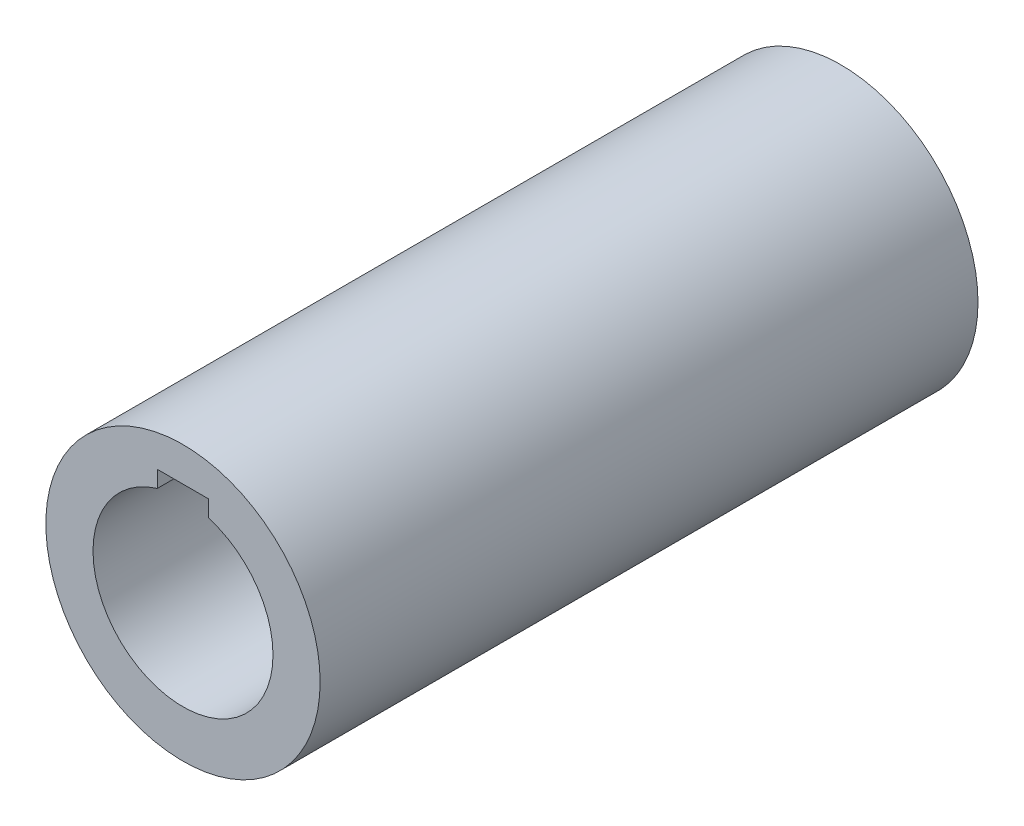
ISO-10303-21;
HEADER;
FILE_DESCRIPTION(('STEP AP214'),'2;1');
FILE_NAME('part.step','',(''),(''),'','','');
FILE_SCHEMA(('AUTOMOTIVE_DESIGN { 1 0 10303 214 1 1 1 1 }'));
ENDSEC;
DATA;
#1=APPLICATION_CONTEXT('core data for automotive mechanical design processes');
#2=APPLICATION_PROTOCOL_DEFINITION('international standard','automotive_design',2000,#1);
#3=PRODUCT_CONTEXT('',#1,'mechanical');
#4=PRODUCT('Part','Part','',(#3));
#5=PRODUCT_RELATED_PRODUCT_CATEGORY('part','',(#4));
#6=PRODUCT_DEFINITION_FORMATION('','',#4);
#7=PRODUCT_DEFINITION_CONTEXT('part definition',#1,'design');
#8=PRODUCT_DEFINITION('design','',#6,#7);
#9=PRODUCT_DEFINITION_SHAPE('','',#8);
#10=(LENGTH_UNIT() NAMED_UNIT(*) SI_UNIT(.MILLI.,.METRE.));
#11=(NAMED_UNIT(*) PLANE_ANGLE_UNIT() SI_UNIT($,.RADIAN.));
#12=(NAMED_UNIT(*) SI_UNIT($,.STERADIAN.) SOLID_ANGLE_UNIT());
#13=UNCERTAINTY_MEASURE_WITH_UNIT(LENGTH_MEASURE(1.E-05),#10,'distance_accuracy_value','');
#14=(GEOMETRIC_REPRESENTATION_CONTEXT(3) GLOBAL_UNCERTAINTY_ASSIGNED_CONTEXT((#13)) GLOBAL_UNIT_ASSIGNED_CONTEXT((#10,
#11,#12)) REPRESENTATION_CONTEXT('',''));
#15=CARTESIAN_POINT('',(0.,0.,0.));
#16=DIRECTION('',(0.,0.,1.));
#17=DIRECTION('',(1.,0.,0.));
#18=AXIS2_PLACEMENT_3D('',#15,#16,#17);
#19=CARTESIAN_POINT('',(0.,0.,153.5));
#20=DIRECTION('',(0.,0.,1.));
#21=DIRECTION('',(1.,0.,0.));
#22=AXIS2_PLACEMENT_3D('',#19,#20,#21);
#23=PLANE('',#22);
#24=DIRECTION('',(0.,-1.,0.));
#25=VECTOR('',#24,1.);
#26=CARTESIAN_POINT('',(-6.,24.,153.5));
#27=LINE('',#26,#25);
#28=CARTESIAN_POINT('',(-6.,24.,153.5));
#29=VERTEX_POINT('',#28);
#30=CARTESIAN_POINT('',(-6.,20.1246117974981,153.5));
#31=VERTEX_POINT('',#30);
#32=EDGE_CURVE('E81',#29,#31,#27,.T.);
#33=ORIENTED_EDGE('',*,*,#32,.F.);
#34=DIRECTION('',(-1.,0.,0.));
#35=VECTOR('',#34,1.);
#36=CARTESIAN_POINT('',(-6.,24.,153.5));
#37=LINE('',#36,#35);
#38=CARTESIAN_POINT('',(6.,24.,153.5));
#39=VERTEX_POINT('',#38);
#40=EDGE_CURVE('E93',#39,#29,#37,.T.);
#41=ORIENTED_EDGE('',*,*,#40,.F.);
#42=DIRECTION('',(0.,1.,0.));
#43=VECTOR('',#42,1.);
#44=CARTESIAN_POINT('',(6.,24.,153.5));
#45=LINE('',#44,#43);
#46=CARTESIAN_POINT('',(6.,20.1246117974981,153.5));
#47=VERTEX_POINT('',#46);
#48=EDGE_CURVE('E105',#47,#39,#45,.T.);
#49=ORIENTED_EDGE('',*,*,#48,.F.);
#50=CARTESIAN_POINT('',(0.,0.,153.5));
#51=DIRECTION('',(0.,0.,1.));
#52=DIRECTION('',(1.,0.,0.));
#53=AXIS2_PLACEMENT_3D('',#50,#51,#52);
#54=CIRCLE('',#53,21.);
#55=EDGE_CURVE('E96',#31,#47,#54,.T.);
#56=ORIENTED_EDGE('',*,*,#55,.F.);
#57=EDGE_LOOP('',(#33,#41,#49,#56));
#58=FACE_BOUND('',#57,.T.);
#59=CARTESIAN_POINT('',(0.,0.,153.5));
#60=DIRECTION('',(0.,0.,1.));
#61=DIRECTION('',(1.,0.,0.));
#62=AXIS2_PLACEMENT_3D('',#59,#60,#61);
#63=CIRCLE('',#62,32.);
#64=CARTESIAN_POINT('',(32.,0.,153.5));
#65=VERTEX_POINT('',#64);
#66=EDGE_CURVE('E11',#65,#65,#63,.T.);
#67=ORIENTED_EDGE('',*,*,#66,.T.);
#68=EDGE_LOOP('',(#67));
#69=FACE_BOUND('',#68,.T.);
#70=ADVANCED_FACE('F34',(#58,#69),#23,.T.);
#71=CARTESIAN_POINT('',(0.,0.,0.));
#72=DIRECTION('',(0.,0.,1.));
#73=DIRECTION('',(1.,0.,0.));
#74=AXIS2_PLACEMENT_3D('',#71,#72,#73);
#75=PLANE('',#74);
#76=CARTESIAN_POINT('',(0.,0.,0.));
#77=DIRECTION('',(0.,0.,1.));
#78=DIRECTION('',(1.,0.,0.));
#79=AXIS2_PLACEMENT_3D('',#76,#77,#78);
#80=CIRCLE('',#79,32.);
#81=CARTESIAN_POINT('',(32.,0.,0.));
#82=VERTEX_POINT('',#81);
#83=EDGE_CURVE('E38',#82,#82,#80,.T.);
#84=ORIENTED_EDGE('',*,*,#83,.F.);
#85=EDGE_LOOP('',(#84));
#86=FACE_BOUND('',#85,.T.);
#87=DIRECTION('',(-1.,0.,0.));
#88=VECTOR('',#87,1.);
#89=CARTESIAN_POINT('',(-6.,24.,0.));
#90=LINE('',#89,#88);
#91=CARTESIAN_POINT('',(6.,24.,0.));
#92=VERTEX_POINT('',#91);
#93=CARTESIAN_POINT('',(-6.,24.,0.));
#94=VERTEX_POINT('',#93);
#95=EDGE_CURVE('E87',#92,#94,#90,.T.);
#96=ORIENTED_EDGE('',*,*,#95,.T.);
#97=DIRECTION('',(0.,-1.,0.));
#98=VECTOR('',#97,1.);
#99=CARTESIAN_POINT('',(-6.,24.,0.));
#100=LINE('',#99,#98);
#101=CARTESIAN_POINT('',(-6.,20.1246117974981,0.));
#102=VERTEX_POINT('',#101);
#103=EDGE_CURVE('E78',#94,#102,#100,.T.);
#104=ORIENTED_EDGE('',*,*,#103,.T.);
#105=CARTESIAN_POINT('',(0.,0.,0.));
#106=DIRECTION('',(0.,0.,1.));
#107=DIRECTION('',(1.,0.,0.));
#108=AXIS2_PLACEMENT_3D('',#105,#106,#107);
#109=CIRCLE('',#108,21.);
#110=CARTESIAN_POINT('',(6.,20.1246117974981,0.));
#111=VERTEX_POINT('',#110);
#112=EDGE_CURVE('E92',#102,#111,#109,.T.);
#113=ORIENTED_EDGE('',*,*,#112,.T.);
#114=DIRECTION('',(0.,1.,0.));
#115=VECTOR('',#114,1.);
#116=CARTESIAN_POINT('',(6.,24.,0.));
#117=LINE('',#116,#115);
#118=EDGE_CURVE('E49',#111,#92,#117,.T.);
#119=ORIENTED_EDGE('',*,*,#118,.T.);
#120=EDGE_LOOP('',(#96,#104,#113,#119));
#121=FACE_BOUND('',#120,.T.);
#122=ADVANCED_FACE('F91',(#86,#121),#75,.F.);
#123=CARTESIAN_POINT('',(0.,0.,153.5));
#124=DIRECTION('',(0.,0.,-1.));
#125=DIRECTION('',(-1.,0.,0.));
#126=AXIS2_PLACEMENT_3D('',#123,#124,#125);
#127=CYLINDRICAL_SURFACE('',#126,32.);
#128=ORIENTED_EDGE('',*,*,#66,.F.);
#129=EDGE_LOOP('',(#128));
#130=FACE_BOUND('',#129,.T.);
#131=ORIENTED_EDGE('',*,*,#83,.T.);
#132=EDGE_LOOP('',(#131));
#133=FACE_BOUND('',#132,.T.);
#134=ADVANCED_FACE('F36',(#130,#133),#127,.T.);
#135=CARTESIAN_POINT('',(0.,0.,153.5));
#136=DIRECTION('',(0.,0.,-1.));
#137=DIRECTION('',(-1.,0.,0.));
#138=AXIS2_PLACEMENT_3D('',#135,#136,#137);
#139=CYLINDRICAL_SURFACE('',#138,21.);
#140=DIRECTION('',(0.,0.,1.));
#141=VECTOR('',#140,1.);
#142=CARTESIAN_POINT('',(-6.,20.1246117974981,0.));
#143=LINE('',#142,#141);
#144=EDGE_CURVE('E75',#102,#31,#143,.T.);
#145=ORIENTED_EDGE('',*,*,#144,.T.);
#146=ORIENTED_EDGE('',*,*,#55,.T.);
#147=DIRECTION('',(0.,0.,1.));
#148=VECTOR('',#147,1.);
#149=CARTESIAN_POINT('',(6.,20.1246117974981,0.));
#150=LINE('',#149,#148);
#151=EDGE_CURVE('E86',#111,#47,#150,.T.);
#152=ORIENTED_EDGE('',*,*,#151,.F.);
#153=ORIENTED_EDGE('',*,*,#112,.F.);
#154=EDGE_LOOP('',(#145,#146,#152,#153));
#155=FACE_BOUND('',#154,.T.);
#156=ADVANCED_FACE('F95',(#155),#139,.F.);
#157=CARTESIAN_POINT('',(-6.,24.,0.));
#158=DIRECTION('',(-1.,0.,0.));
#159=DIRECTION('',(0.,-1.,0.));
#160=AXIS2_PLACEMENT_3D('',#157,#158,#159);
#161=PLANE('',#160);
#162=ORIENTED_EDGE('',*,*,#32,.T.);
#163=ORIENTED_EDGE('',*,*,#144,.F.);
#164=ORIENTED_EDGE('',*,*,#103,.F.);
#165=DIRECTION('',(0.,0.,1.));
#166=VECTOR('',#165,1.);
#167=CARTESIAN_POINT('',(-6.,24.,0.));
#168=LINE('',#167,#166);
#169=EDGE_CURVE('E58',#94,#29,#168,.T.);
#170=ORIENTED_EDGE('',*,*,#169,.T.);
#171=EDGE_LOOP('',(#162,#163,#164,#170));
#172=FACE_BOUND('',#171,.T.);
#173=ADVANCED_FACE('F77',(#172),#161,.F.);
#174=CARTESIAN_POINT('',(-6.,24.,0.));
#175=DIRECTION('',(0.,1.,0.));
#176=DIRECTION('',(0.,0.,1.));
#177=AXIS2_PLACEMENT_3D('',#174,#175,#176);
#178=PLANE('',#177);
#179=ORIENTED_EDGE('',*,*,#40,.T.);
#180=ORIENTED_EDGE('',*,*,#169,.F.);
#181=ORIENTED_EDGE('',*,*,#95,.F.);
#182=DIRECTION('',(0.,0.,1.));
#183=VECTOR('',#182,1.);
#184=CARTESIAN_POINT('',(6.,24.,0.));
#185=LINE('',#184,#183);
#186=EDGE_CURVE('E99',#92,#39,#185,.T.);
#187=ORIENTED_EDGE('',*,*,#186,.T.);
#188=EDGE_LOOP('',(#179,#180,#181,#187));
#189=FACE_BOUND('',#188,.T.);
#190=ADVANCED_FACE('F115',(#189),#178,.F.);
#191=CARTESIAN_POINT('',(6.,24.,0.));
#192=DIRECTION('',(1.,0.,0.));
#193=DIRECTION('',(0.,1.,0.));
#194=AXIS2_PLACEMENT_3D('',#191,#192,#193);
#195=PLANE('',#194);
#196=ORIENTED_EDGE('',*,*,#48,.T.);
#197=ORIENTED_EDGE('',*,*,#186,.F.);
#198=ORIENTED_EDGE('',*,*,#118,.F.);
#199=ORIENTED_EDGE('',*,*,#151,.T.);
#200=EDGE_LOOP('',(#196,#197,#198,#199));
#201=FACE_BOUND('',#200,.T.);
#202=ADVANCED_FACE('F112',(#201),#195,.F.);
#203=CLOSED_SHELL('',(#70,#122,#134,#156,#173,#190,#202));
#204=MANIFOLD_SOLID_BREP('B2',#203);
#205=ADVANCED_BREP_SHAPE_REPRESENTATION('',(#18,#204),#14);
#206=SHAPE_DEFINITION_REPRESENTATION(#9,#205);
ENDSEC;
END-ISO-10303-21;
